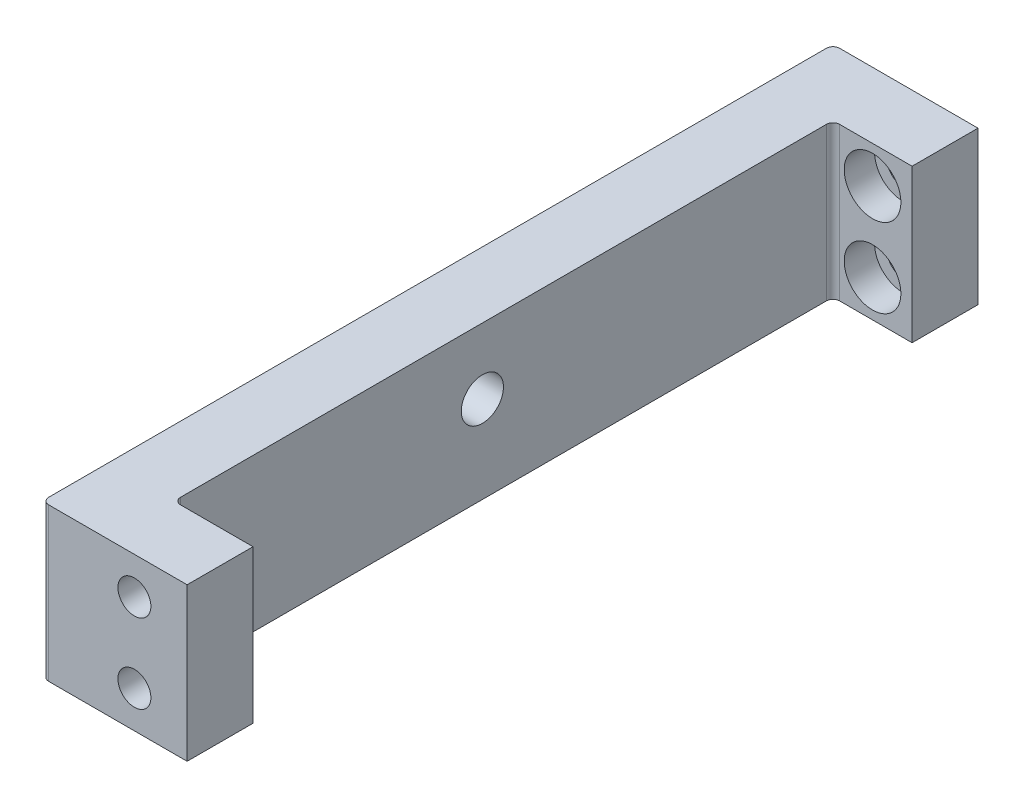
ISO-10303-21;
HEADER;
FILE_DESCRIPTION(('STEP AP214'),'2;1');
FILE_NAME('part.step','',(''),(''),'','','');
FILE_SCHEMA(('AUTOMOTIVE_DESIGN { 1 0 10303 214 1 1 1 1 }'));
ENDSEC;
DATA;
#1=APPLICATION_CONTEXT('core data for automotive mechanical design processes');
#2=APPLICATION_PROTOCOL_DEFINITION('international standard','automotive_design',2000,#1);
#3=PRODUCT_CONTEXT('',#1,'mechanical');
#4=PRODUCT('Part','Part','',(#3));
#5=PRODUCT_RELATED_PRODUCT_CATEGORY('part','',(#4));
#6=PRODUCT_DEFINITION_FORMATION('','',#4);
#7=PRODUCT_DEFINITION_CONTEXT('part definition',#1,'design');
#8=PRODUCT_DEFINITION('design','',#6,#7);
#9=PRODUCT_DEFINITION_SHAPE('','',#8);
#10=(LENGTH_UNIT() NAMED_UNIT(*) SI_UNIT(.MILLI.,.METRE.));
#11=(NAMED_UNIT(*) PLANE_ANGLE_UNIT() SI_UNIT($,.RADIAN.));
#12=(NAMED_UNIT(*) SI_UNIT($,.STERADIAN.) SOLID_ANGLE_UNIT());
#13=UNCERTAINTY_MEASURE_WITH_UNIT(LENGTH_MEASURE(1.E-05),#10,'distance_accuracy_value','');
#14=(GEOMETRIC_REPRESENTATION_CONTEXT(3) GLOBAL_UNCERTAINTY_ASSIGNED_CONTEXT((#13)) GLOBAL_UNIT_ASSIGNED_CONTEXT((#10,
#11,#12)) REPRESENTATION_CONTEXT('',''));
#15=CARTESIAN_POINT('',(0.,0.,0.));
#16=DIRECTION('',(0.,0.,1.));
#17=DIRECTION('',(1.,0.,0.));
#18=AXIS2_PLACEMENT_3D('',#15,#16,#17);
#19=CARTESIAN_POINT('',(2.5,-5.8,30.));
#20=DIRECTION('',(-1.,0.,0.));
#21=DIRECTION('',(0.,0.,1.));
#22=AXIS2_PLACEMENT_3D('',#19,#20,#21);
#23=PLANE('',#22);
#24=CARTESIAN_POINT('',(2.5,0.799999999999973,1.6));
#25=DIRECTION('',(-1.,0.,0.));
#26=DIRECTION('',(0.,0.,1.));
#27=AXIS2_PLACEMENT_3D('',#24,#25,#26);
#28=CIRCLE('',#27,1.59999999999999);
#29=CARTESIAN_POINT('',(2.5,0.799999999999973,3.19999999999999));
#30=VERTEX_POINT('',#29);
#31=EDGE_CURVE('E153',#30,#30,#28,.T.);
#32=ORIENTED_EDGE('',*,*,#31,.T.);
#33=EDGE_LOOP('',(#32));
#34=FACE_BOUND('',#33,.T.);
#35=DIRECTION('',(0.,0.,-1.));
#36=VECTOR('',#35,1.);
#37=CARTESIAN_POINT('',(2.5,-5.8,30.));
#38=LINE('',#37,#36);
#39=CARTESIAN_POINT('',(2.5,-5.8,24.5));
#40=VERTEX_POINT('',#39);
#41=CARTESIAN_POINT('',(2.5,-5.8,-24.5));
#42=VERTEX_POINT('',#41);
#43=EDGE_CURVE('E271',#40,#42,#38,.T.);
#44=ORIENTED_EDGE('',*,*,#43,.T.);
#45=DIRECTION('',(0.,1.,0.));
#46=VECTOR('',#45,1.);
#47=CARTESIAN_POINT('',(2.5,-5.80000000000002,-24.5));
#48=LINE('',#47,#46);
#49=CARTESIAN_POINT('',(2.5,5.8,-24.5));
#50=VERTEX_POINT('',#49);
#51=EDGE_CURVE('E309',#42,#50,#48,.T.);
#52=ORIENTED_EDGE('',*,*,#51,.T.);
#53=DIRECTION('',(0.,0.,-1.));
#54=VECTOR('',#53,1.);
#55=CARTESIAN_POINT('',(2.5,5.8,30.));
#56=LINE('',#55,#54);
#57=CARTESIAN_POINT('',(2.5,5.8,24.5));
#58=VERTEX_POINT('',#57);
#59=EDGE_CURVE('E268',#58,#50,#56,.T.);
#60=ORIENTED_EDGE('',*,*,#59,.F.);
#61=DIRECTION('',(0.,1.,0.));
#62=VECTOR('',#61,1.);
#63=CARTESIAN_POINT('',(2.5,-5.8,24.5));
#64=LINE('',#63,#62);
#65=EDGE_CURVE('E306',#58,#40,#64,.F.);
#66=ORIENTED_EDGE('',*,*,#65,.T.);
#67=EDGE_LOOP('',(#44,#52,#60,#66));
#68=FACE_BOUND('',#67,.T.);
#69=ADVANCED_FACE('F46',(#34,#68),#23,.F.);
#70=CARTESIAN_POINT('',(-2.5,-5.8,30.));
#71=DIRECTION('',(1.,0.,0.));
#72=DIRECTION('',(0.,0.,-1.));
#73=AXIS2_PLACEMENT_3D('',#70,#71,#72);
#74=PLANE('',#73);
#75=CARTESIAN_POINT('',(-2.5,0.799999999999973,1.6));
#76=DIRECTION('',(-1.,0.,0.));
#77=DIRECTION('',(0.,0.,1.));
#78=AXIS2_PLACEMENT_3D('',#75,#76,#77);
#79=CIRCLE('',#78,1.59999999999999);
#80=CARTESIAN_POINT('',(-2.5,0.799999999999973,3.19999999999999));
#81=VERTEX_POINT('',#80);
#82=EDGE_CURVE('E147',#81,#81,#79,.T.);
#83=ORIENTED_EDGE('',*,*,#82,.F.);
#84=EDGE_LOOP('',(#83));
#85=FACE_BOUND('',#84,.T.);
#86=DIRECTION('',(0.,0.,-1.));
#87=VECTOR('',#86,1.);
#88=CARTESIAN_POINT('',(-2.5,5.8,30.));
#89=LINE('',#88,#87);
#90=CARTESIAN_POINT('',(-2.5,5.8,29.5));
#91=VERTEX_POINT('',#90);
#92=CARTESIAN_POINT('',(-2.5,5.8,-29.5));
#93=VERTEX_POINT('',#92);
#94=EDGE_CURVE('E259',#91,#93,#89,.T.);
#95=ORIENTED_EDGE('',*,*,#94,.T.);
#96=DIRECTION('',(0.,-1.,0.));
#97=VECTOR('',#96,1.);
#98=CARTESIAN_POINT('',(-2.5,-5.8,-29.5));
#99=LINE('',#98,#97);
#100=CARTESIAN_POINT('',(-2.5,-5.8,-29.5));
#101=VERTEX_POINT('',#100);
#102=EDGE_CURVE('E288',#93,#101,#99,.T.);
#103=ORIENTED_EDGE('',*,*,#102,.T.);
#104=DIRECTION('',(0.,0.,-1.));
#105=VECTOR('',#104,1.);
#106=CARTESIAN_POINT('',(-2.5,-5.8,30.));
#107=LINE('',#106,#105);
#108=CARTESIAN_POINT('',(-2.5,-5.8,29.5));
#109=VERTEX_POINT('',#108);
#110=EDGE_CURVE('E275',#109,#101,#107,.T.);
#111=ORIENTED_EDGE('',*,*,#110,.F.);
#112=DIRECTION('',(0.,-1.,0.));
#113=VECTOR('',#112,1.);
#114=CARTESIAN_POINT('',(-2.5,5.8,29.5));
#115=LINE('',#114,#113);
#116=EDGE_CURVE('E279',#109,#91,#115,.F.);
#117=ORIENTED_EDGE('',*,*,#116,.T.);
#118=EDGE_LOOP('',(#95,#103,#111,#117));
#119=FACE_BOUND('',#118,.T.);
#120=ADVANCED_FACE('F358',(#85,#119),#74,.F.);
#121=CARTESIAN_POINT('',(2.5,-5.8,30.));
#122=DIRECTION('',(0.,1.,0.));
#123=DIRECTION('',(0.,0.,1.));
#124=AXIS2_PLACEMENT_3D('',#121,#122,#123);
#125=PLANE('',#124);
#126=CARTESIAN_POINT('',(0.325000000000023,-5.8,-8.99999999999999));
#127=DIRECTION('',(0.,-1.,0.));
#128=DIRECTION('',(0.,0.,-1.));
#129=AXIS2_PLACEMENT_3D('',#126,#127,#128);
#130=CIRCLE('',#129,0.79999999999999);
#131=CARTESIAN_POINT('',(0.325000000000023,-5.8,-9.79999999999998));
#132=VERTEX_POINT('',#131);
#133=EDGE_CURVE('E148',#132,#132,#130,.T.);
#134=ORIENTED_EDGE('',*,*,#133,.F.);
#135=EDGE_LOOP('',(#134));
#136=FACE_BOUND('',#135,.T.);
#137=ORIENTED_EDGE('',*,*,#110,.T.);
#138=CARTESIAN_POINT('',(-2.,-5.8,-29.5));
#139=DIRECTION('',(0.,1.,0.));
#140=DIRECTION('',(0.,0.,1.));
#141=AXIS2_PLACEMENT_3D('',#138,#139,#140);
#142=CIRCLE('',#141,0.5);
#143=CARTESIAN_POINT('',(-2.,-5.8,-30.));
#144=VERTEX_POINT('',#143);
#145=EDGE_CURVE('E295',#101,#144,#142,.F.);
#146=ORIENTED_EDGE('',*,*,#145,.T.);
#147=DIRECTION('',(1.,0.,0.));
#148=VECTOR('',#147,1.);
#149=CARTESIAN_POINT('',(2.5,-5.8,-30.));
#150=LINE('',#149,#148);
#151=CARTESIAN_POINT('',(8.5,-5.8,-30.));
#152=VERTEX_POINT('',#151);
#153=EDGE_CURVE('E250',#144,#152,#150,.T.);
#154=ORIENTED_EDGE('',*,*,#153,.T.);
#155=DIRECTION('',(0.,0.,1.));
#156=VECTOR('',#155,1.);
#157=CARTESIAN_POINT('',(8.5,-5.8,-25.));
#158=LINE('',#157,#156);
#159=CARTESIAN_POINT('',(8.5,-5.8,-25.));
#160=VERTEX_POINT('',#159);
#161=EDGE_CURVE('E204',#152,#160,#158,.T.);
#162=ORIENTED_EDGE('',*,*,#161,.T.);
#163=DIRECTION('',(-1.,0.,0.));
#164=VECTOR('',#163,1.);
#165=CARTESIAN_POINT('',(8.5,-5.8,-25.));
#166=LINE('',#165,#164);
#167=CARTESIAN_POINT('',(3.,-5.8,-25.));
#168=VERTEX_POINT('',#167);
#169=EDGE_CURVE('E220',#160,#168,#166,.T.);
#170=ORIENTED_EDGE('',*,*,#169,.T.);
#171=CARTESIAN_POINT('',(3.,-5.8,-24.5));
#172=DIRECTION('',(0.,1.,0.));
#173=DIRECTION('',(0.,0.,1.));
#174=AXIS2_PLACEMENT_3D('',#171,#172,#173);
#175=CIRCLE('',#174,0.5);
#176=EDGE_CURVE('E325',#168,#42,#175,.T.);
#177=ORIENTED_EDGE('',*,*,#176,.T.);
#178=ORIENTED_EDGE('',*,*,#43,.F.);
#179=CARTESIAN_POINT('',(3.,-5.8,24.5));
#180=DIRECTION('',(0.,1.,0.));
#181=DIRECTION('',(0.,0.,1.));
#182=AXIS2_PLACEMENT_3D('',#179,#180,#181);
#183=CIRCLE('',#182,0.5);
#184=CARTESIAN_POINT('',(3.,-5.8,25.));
#185=VERTEX_POINT('',#184);
#186=EDGE_CURVE('E11',#40,#185,#183,.T.);
#187=ORIENTED_EDGE('',*,*,#186,.T.);
#188=DIRECTION('',(-1.,0.,0.));
#189=VECTOR('',#188,1.);
#190=CARTESIAN_POINT('',(8.5,-5.8,25.));
#191=LINE('',#190,#189);
#192=CARTESIAN_POINT('',(8.5,-5.8,25.));
#193=VERTEX_POINT('',#192);
#194=EDGE_CURVE('E246',#193,#185,#191,.T.);
#195=ORIENTED_EDGE('',*,*,#194,.F.);
#196=DIRECTION('',(0.,0.,-1.));
#197=VECTOR('',#196,1.);
#198=CARTESIAN_POINT('',(8.5,-5.8,25.));
#199=LINE('',#198,#197);
#200=CARTESIAN_POINT('',(8.5,-5.8,30.));
#201=VERTEX_POINT('',#200);
#202=EDGE_CURVE('E227',#201,#193,#199,.T.);
#203=ORIENTED_EDGE('',*,*,#202,.F.);
#204=DIRECTION('',(1.,0.,0.));
#205=VECTOR('',#204,1.);
#206=CARTESIAN_POINT('',(2.5,-5.8,30.));
#207=LINE('',#206,#205);
#208=CARTESIAN_POINT('',(-2.,-5.8,30.));
#209=VERTEX_POINT('',#208);
#210=EDGE_CURVE('E251',#209,#201,#207,.T.);
#211=ORIENTED_EDGE('',*,*,#210,.F.);
#212=CARTESIAN_POINT('',(-2.,-5.8,29.5));
#213=DIRECTION('',(0.,1.,0.));
#214=DIRECTION('',(0.,0.,1.));
#215=AXIS2_PLACEMENT_3D('',#212,#213,#214);
#216=CIRCLE('',#215,0.5);
#217=EDGE_CURVE('E292',#209,#109,#216,.F.);
#218=ORIENTED_EDGE('',*,*,#217,.T.);
#219=EDGE_LOOP('',(#137,#146,#154,#162,#170,#177,#178,#187,#195,#203,#211,#218));
#220=FACE_BOUND('',#219,.T.);
#221=ADVANCED_FACE('F341',(#136,#220),#125,.F.);
#222=CARTESIAN_POINT('',(2.5,5.8,30.));
#223=DIRECTION('',(0.,-1.,0.));
#224=DIRECTION('',(0.,0.,-1.));
#225=AXIS2_PLACEMENT_3D('',#222,#223,#224);
#226=PLANE('',#225);
#227=DIRECTION('',(-1.,0.,0.));
#228=VECTOR('',#227,1.);
#229=CARTESIAN_POINT('',(2.5,5.8,-30.));
#230=LINE('',#229,#228);
#231=CARTESIAN_POINT('',(8.5,5.8,-30.));
#232=VERTEX_POINT('',#231);
#233=CARTESIAN_POINT('',(-2.,5.8,-30.));
#234=VERTEX_POINT('',#233);
#235=EDGE_CURVE('E255',#232,#234,#230,.T.);
#236=ORIENTED_EDGE('',*,*,#235,.T.);
#237=CARTESIAN_POINT('',(-2.,5.8,-29.5));
#238=DIRECTION('',(0.,-1.,0.));
#239=DIRECTION('',(0.,0.,-1.));
#240=AXIS2_PLACEMENT_3D('',#237,#238,#239);
#241=CIRCLE('',#240,0.5);
#242=EDGE_CURVE('E303',#234,#93,#241,.F.);
#243=ORIENTED_EDGE('',*,*,#242,.T.);
#244=ORIENTED_EDGE('',*,*,#94,.F.);
#245=CARTESIAN_POINT('',(-2.,5.8,29.5));
#246=DIRECTION('',(0.,-1.,0.));
#247=DIRECTION('',(0.,0.,-1.));
#248=AXIS2_PLACEMENT_3D('',#245,#246,#247);
#249=CIRCLE('',#248,0.5);
#250=CARTESIAN_POINT('',(-2.,5.8,30.));
#251=VERTEX_POINT('',#250);
#252=EDGE_CURVE('E300',#91,#251,#249,.F.);
#253=ORIENTED_EDGE('',*,*,#252,.T.);
#254=DIRECTION('',(-1.,0.,0.));
#255=VECTOR('',#254,1.);
#256=CARTESIAN_POINT('',(2.5,5.8,30.));
#257=LINE('',#256,#255);
#258=CARTESIAN_POINT('',(8.5,5.8,30.));
#259=VERTEX_POINT('',#258);
#260=EDGE_CURVE('E254',#259,#251,#257,.T.);
#261=ORIENTED_EDGE('',*,*,#260,.F.);
#262=DIRECTION('',(0.,0.,1.));
#263=VECTOR('',#262,1.);
#264=CARTESIAN_POINT('',(8.5,5.8,30.));
#265=LINE('',#264,#263);
#266=CARTESIAN_POINT('',(8.5,5.8,25.));
#267=VERTEX_POINT('',#266);
#268=EDGE_CURVE('E234',#267,#259,#265,.T.);
#269=ORIENTED_EDGE('',*,*,#268,.F.);
#270=DIRECTION('',(-1.,0.,0.));
#271=VECTOR('',#270,1.);
#272=CARTESIAN_POINT('',(8.5,5.8,25.));
#273=LINE('',#272,#271);
#274=CARTESIAN_POINT('',(3.,5.8,25.));
#275=VERTEX_POINT('',#274);
#276=EDGE_CURVE('E242',#267,#275,#273,.T.);
#277=ORIENTED_EDGE('',*,*,#276,.T.);
#278=CARTESIAN_POINT('',(3.,5.8,24.5));
#279=DIRECTION('',(0.,-1.,0.));
#280=DIRECTION('',(0.,0.,-1.));
#281=AXIS2_PLACEMENT_3D('',#278,#279,#280);
#282=CIRCLE('',#281,0.5);
#283=EDGE_CURVE('E55',#275,#58,#282,.T.);
#284=ORIENTED_EDGE('',*,*,#283,.T.);
#285=ORIENTED_EDGE('',*,*,#59,.T.);
#286=CARTESIAN_POINT('',(3.,5.8,-24.5));
#287=DIRECTION('',(0.,-1.,0.));
#288=DIRECTION('',(0.,0.,-1.));
#289=AXIS2_PLACEMENT_3D('',#286,#287,#288);
#290=CIRCLE('',#289,0.5);
#291=CARTESIAN_POINT('',(3.,5.8,-25.));
#292=VERTEX_POINT('',#291);
#293=EDGE_CURVE('E62',#50,#292,#290,.T.);
#294=ORIENTED_EDGE('',*,*,#293,.T.);
#295=DIRECTION('',(-1.,0.,0.));
#296=VECTOR('',#295,1.);
#297=CARTESIAN_POINT('',(8.5,5.8,-25.));
#298=LINE('',#297,#296);
#299=CARTESIAN_POINT('',(8.5,5.8,-25.));
#300=VERTEX_POINT('',#299);
#301=EDGE_CURVE('E224',#300,#292,#298,.T.);
#302=ORIENTED_EDGE('',*,*,#301,.F.);
#303=DIRECTION('',(0.,0.,-1.));
#304=VECTOR('',#303,1.);
#305=CARTESIAN_POINT('',(8.5,5.8,-30.));
#306=LINE('',#305,#304);
#307=EDGE_CURVE('E212',#300,#232,#306,.T.);
#308=ORIENTED_EDGE('',*,*,#307,.T.);
#309=EDGE_LOOP('',(#236,#243,#244,#253,#261,#269,#277,#284,#285,#294,#302,#308));
#310=FACE_BOUND('',#309,.T.);
#311=ADVANCED_FACE('F329',(#310),#226,.F.);
#312=CARTESIAN_POINT('',(0.,0.,30.));
#313=DIRECTION('',(0.,0.,1.));
#314=DIRECTION('',(1.,0.,0.));
#315=AXIS2_PLACEMENT_3D('',#312,#313,#314);
#316=PLANE('',#315);
#317=CARTESIAN_POINT('',(4.5,-3.,30.));
#318=DIRECTION('',(0.,0.,1.));
#319=DIRECTION('',(1.,0.,0.));
#320=AXIS2_PLACEMENT_3D('',#317,#318,#319);
#321=CIRCLE('',#320,1.24999999999999);
#322=CARTESIAN_POINT('',(5.74999999999999,-3.,30.));
#323=VERTEX_POINT('',#322);
#324=EDGE_CURVE('E188',#323,#323,#321,.T.);
#325=ORIENTED_EDGE('',*,*,#324,.F.);
#326=EDGE_LOOP('',(#325));
#327=FACE_BOUND('',#326,.T.);
#328=CARTESIAN_POINT('',(4.5,3.,30.));
#329=DIRECTION('',(0.,0.,1.));
#330=DIRECTION('',(1.,0.,0.));
#331=AXIS2_PLACEMENT_3D('',#328,#329,#330);
#332=CIRCLE('',#331,1.24999999999999);
#333=CARTESIAN_POINT('',(5.74999999999999,3.,30.));
#334=VERTEX_POINT('',#333);
#335=EDGE_CURVE('E196',#334,#334,#332,.T.);
#336=ORIENTED_EDGE('',*,*,#335,.F.);
#337=EDGE_LOOP('',(#336));
#338=FACE_BOUND('',#337,.T.);
#339=ORIENTED_EDGE('',*,*,#260,.T.);
#340=DIRECTION('',(0.,-1.,0.));
#341=VECTOR('',#340,1.);
#342=CARTESIAN_POINT('',(-2.,-5.8,30.));
#343=LINE('',#342,#341);
#344=EDGE_CURVE('E319',#251,#209,#343,.T.);
#345=ORIENTED_EDGE('',*,*,#344,.T.);
#346=ORIENTED_EDGE('',*,*,#210,.T.);
#347=DIRECTION('',(0.,-1.,0.));
#348=VECTOR('',#347,1.);
#349=CARTESIAN_POINT('',(8.5,-5.8,30.));
#350=LINE('',#349,#348);
#351=EDGE_CURVE('E238',#259,#201,#350,.T.);
#352=ORIENTED_EDGE('',*,*,#351,.F.);
#353=EDGE_LOOP('',(#339,#345,#346,#352));
#354=FACE_BOUND('',#353,.T.);
#355=ADVANCED_FACE('F351',(#327,#338,#354),#316,.T.);
#356=CARTESIAN_POINT('',(0.,0.,-30.));
#357=DIRECTION('',(0.,0.,1.));
#358=DIRECTION('',(1.,0.,0.));
#359=AXIS2_PLACEMENT_3D('',#356,#357,#358);
#360=PLANE('',#359);
#361=CARTESIAN_POINT('',(5.5,-3.00000000000001,-30.));
#362=DIRECTION('',(0.,0.,1.));
#363=DIRECTION('',(1.,0.,0.));
#364=AXIS2_PLACEMENT_3D('',#361,#362,#363);
#365=CIRCLE('',#364,1.2);
#366=CARTESIAN_POINT('',(6.7,-3.00000000000001,-30.));
#367=VERTEX_POINT('',#366);
#368=EDGE_CURVE('E174',#367,#367,#365,.T.);
#369=ORIENTED_EDGE('',*,*,#368,.T.);
#370=EDGE_LOOP('',(#369));
#371=FACE_BOUND('',#370,.T.);
#372=CARTESIAN_POINT('',(5.5,2.99999999999999,-30.));
#373=DIRECTION('',(0.,0.,1.));
#374=DIRECTION('',(1.,0.,0.));
#375=AXIS2_PLACEMENT_3D('',#372,#373,#374);
#376=CIRCLE('',#375,1.2);
#377=CARTESIAN_POINT('',(6.7,2.99999999999999,-30.));
#378=VERTEX_POINT('',#377);
#379=EDGE_CURVE('E187',#378,#378,#376,.T.);
#380=ORIENTED_EDGE('',*,*,#379,.T.);
#381=EDGE_LOOP('',(#380));
#382=FACE_BOUND('',#381,.T.);
#383=ORIENTED_EDGE('',*,*,#153,.F.);
#384=DIRECTION('',(0.,-1.,0.));
#385=VECTOR('',#384,1.);
#386=CARTESIAN_POINT('',(-2.,0.,-30.));
#387=LINE('',#386,#385);
#388=EDGE_CURVE('E297',#144,#234,#387,.F.);
#389=ORIENTED_EDGE('',*,*,#388,.T.);
#390=ORIENTED_EDGE('',*,*,#235,.F.);
#391=DIRECTION('',(0.,-1.,0.));
#392=VECTOR('',#391,1.);
#393=CARTESIAN_POINT('',(8.5,-5.8,-30.));
#394=LINE('',#393,#392);
#395=EDGE_CURVE('E208',#232,#152,#394,.T.);
#396=ORIENTED_EDGE('',*,*,#395,.T.);
#397=EDGE_LOOP('',(#383,#389,#390,#396));
#398=FACE_BOUND('',#397,.T.);
#399=ADVANCED_FACE('F367',(#371,#382,#398),#360,.F.);
#400=CARTESIAN_POINT('',(8.5,5.8,25.));
#401=DIRECTION('',(0.,0.,1.));
#402=DIRECTION('',(0.,-1.,0.));
#403=AXIS2_PLACEMENT_3D('',#400,#401,#402);
#404=PLANE('',#403);
#405=CARTESIAN_POINT('',(4.5,-3.,25.));
#406=DIRECTION('',(0.,0.,1.));
#407=DIRECTION('',(0.,-1.,0.));
#408=AXIS2_PLACEMENT_3D('',#405,#406,#407);
#409=CIRCLE('',#408,1.24999999999999);
#410=CARTESIAN_POINT('',(4.5,-4.24999999999999,25.));
#411=VERTEX_POINT('',#410);
#412=EDGE_CURVE('E192',#411,#411,#409,.T.);
#413=ORIENTED_EDGE('',*,*,#412,.T.);
#414=EDGE_LOOP('',(#413));
#415=FACE_BOUND('',#414,.T.);
#416=CARTESIAN_POINT('',(4.5,3.,25.));
#417=DIRECTION('',(0.,0.,1.));
#418=DIRECTION('',(0.,-1.,0.));
#419=AXIS2_PLACEMENT_3D('',#416,#417,#418);
#420=CIRCLE('',#419,1.24999999999999);
#421=CARTESIAN_POINT('',(4.5,1.75000000000001,25.));
#422=VERTEX_POINT('',#421);
#423=EDGE_CURVE('E200',#422,#422,#420,.T.);
#424=ORIENTED_EDGE('',*,*,#423,.T.);
#425=EDGE_LOOP('',(#424));
#426=FACE_BOUND('',#425,.T.);
#427=ORIENTED_EDGE('',*,*,#194,.T.);
#428=DIRECTION('',(0.,1.,0.));
#429=VECTOR('',#428,1.);
#430=CARTESIAN_POINT('',(3.,5.8,25.));
#431=LINE('',#430,#429);
#432=EDGE_CURVE('E315',#185,#275,#431,.T.);
#433=ORIENTED_EDGE('',*,*,#432,.T.);
#434=ORIENTED_EDGE('',*,*,#276,.F.);
#435=DIRECTION('',(0.,1.,0.));
#436=VECTOR('',#435,1.);
#437=CARTESIAN_POINT('',(8.5,5.8,25.));
#438=LINE('',#437,#436);
#439=EDGE_CURVE('E231',#193,#267,#438,.T.);
#440=ORIENTED_EDGE('',*,*,#439,.F.);
#441=EDGE_LOOP('',(#427,#433,#434,#440));
#442=FACE_BOUND('',#441,.T.);
#443=ADVANCED_FACE('F344',(#415,#426,#442),#404,.F.);
#444=CARTESIAN_POINT('',(8.5,0.,0.));
#445=DIRECTION('',(-1.,0.,0.));
#446=DIRECTION('',(0.,0.,1.));
#447=AXIS2_PLACEMENT_3D('',#444,#445,#446);
#448=PLANE('',#447);
#449=ORIENTED_EDGE('',*,*,#202,.T.);
#450=ORIENTED_EDGE('',*,*,#439,.T.);
#451=ORIENTED_EDGE('',*,*,#268,.T.);
#452=ORIENTED_EDGE('',*,*,#351,.T.);
#453=EDGE_LOOP('',(#449,#450,#451,#452));
#454=FACE_BOUND('',#453,.T.);
#455=ADVANCED_FACE('F346',(#454),#448,.F.);
#456=CARTESIAN_POINT('',(8.5,5.8,-25.));
#457=DIRECTION('',(0.,0.,1.));
#458=DIRECTION('',(0.,-1.,0.));
#459=AXIS2_PLACEMENT_3D('',#456,#457,#458);
#460=PLANE('',#459);
#461=CARTESIAN_POINT('',(5.5,-3.00000000000001,-25.));
#462=DIRECTION('',(0.,0.,1.));
#463=DIRECTION('',(1.,0.,0.));
#464=AXIS2_PLACEMENT_3D('',#461,#462,#463);
#465=CIRCLE('',#464,2.15);
#466=CARTESIAN_POINT('',(7.65,-3.00000000000001,-25.));
#467=VERTEX_POINT('',#466);
#468=EDGE_CURVE('E162',#467,#467,#465,.T.);
#469=ORIENTED_EDGE('',*,*,#468,.F.);
#470=EDGE_LOOP('',(#469));
#471=FACE_BOUND('',#470,.T.);
#472=CARTESIAN_POINT('',(5.5,2.99999999999999,-25.));
#473=DIRECTION('',(0.,0.,1.));
#474=DIRECTION('',(1.,0.,0.));
#475=AXIS2_PLACEMENT_3D('',#472,#473,#474);
#476=CIRCLE('',#475,2.15);
#477=CARTESIAN_POINT('',(7.65,2.99999999999999,-25.));
#478=VERTEX_POINT('',#477);
#479=EDGE_CURVE('E175',#478,#478,#476,.T.);
#480=ORIENTED_EDGE('',*,*,#479,.F.);
#481=EDGE_LOOP('',(#480));
#482=FACE_BOUND('',#481,.T.);
#483=ORIENTED_EDGE('',*,*,#301,.T.);
#484=DIRECTION('',(0.,1.,0.));
#485=VECTOR('',#484,1.);
#486=CARTESIAN_POINT('',(3.,5.8,-25.));
#487=LINE('',#486,#485);
#488=EDGE_CURVE('E312',#292,#168,#487,.F.);
#489=ORIENTED_EDGE('',*,*,#488,.T.);
#490=ORIENTED_EDGE('',*,*,#169,.F.);
#491=DIRECTION('',(0.,1.,0.));
#492=VECTOR('',#491,1.);
#493=CARTESIAN_POINT('',(8.5,5.8,-25.));
#494=LINE('',#493,#492);
#495=EDGE_CURVE('E216',#160,#300,#494,.T.);
#496=ORIENTED_EDGE('',*,*,#495,.T.);
#497=EDGE_LOOP('',(#483,#489,#490,#496));
#498=FACE_BOUND('',#497,.T.);
#499=ADVANCED_FACE('F374',(#471,#482,#498),#460,.T.);
#500=CARTESIAN_POINT('',(8.5,0.,0.));
#501=DIRECTION('',(-1.,0.,0.));
#502=DIRECTION('',(0.,0.,-1.));
#503=AXIS2_PLACEMENT_3D('',#500,#501,#502);
#504=PLANE('',#503);
#505=ORIENTED_EDGE('',*,*,#161,.F.);
#506=ORIENTED_EDGE('',*,*,#395,.F.);
#507=ORIENTED_EDGE('',*,*,#307,.F.);
#508=ORIENTED_EDGE('',*,*,#495,.F.);
#509=EDGE_LOOP('',(#505,#506,#507,#508));
#510=FACE_BOUND('',#509,.T.);
#511=ADVANCED_FACE('F371',(#510),#504,.F.);
#512=CARTESIAN_POINT('',(4.5,3.,30.));
#513=DIRECTION('',(0.,0.,1.));
#514=DIRECTION('',(1.,0.,0.));
#515=AXIS2_PLACEMENT_3D('',#512,#513,#514);
#516=CYLINDRICAL_SURFACE('',#515,1.24999999999999);
#517=ORIENTED_EDGE('',*,*,#335,.T.);
#518=EDGE_LOOP('',(#517));
#519=FACE_BOUND('',#518,.T.);
#520=ORIENTED_EDGE('',*,*,#423,.F.);
#521=EDGE_LOOP('',(#520));
#522=FACE_BOUND('',#521,.T.);
#523=ADVANCED_FACE('F437',(#519,#522),#516,.F.);
#524=CARTESIAN_POINT('',(4.5,-3.,30.));
#525=DIRECTION('',(0.,0.,1.));
#526=DIRECTION('',(1.,0.,0.));
#527=AXIS2_PLACEMENT_3D('',#524,#525,#526);
#528=CYLINDRICAL_SURFACE('',#527,1.24999999999999);
#529=ORIENTED_EDGE('',*,*,#324,.T.);
#530=EDGE_LOOP('',(#529));
#531=FACE_BOUND('',#530,.T.);
#532=ORIENTED_EDGE('',*,*,#412,.F.);
#533=EDGE_LOOP('',(#532));
#534=FACE_BOUND('',#533,.T.);
#535=ADVANCED_FACE('F433',(#531,#534),#528,.F.);
#536=CARTESIAN_POINT('',(5.5,2.99999999999999,-25.));
#537=DIRECTION('',(0.,0.,1.));
#538=DIRECTION('',(1.,0.,0.));
#539=AXIS2_PLACEMENT_3D('',#536,#537,#538);
#540=CYLINDRICAL_SURFACE('',#539,1.2);
#541=CARTESIAN_POINT('',(5.5,2.99999999999999,-27.3));
#542=DIRECTION('',(0.,0.,1.));
#543=DIRECTION('',(1.,0.,0.));
#544=AXIS2_PLACEMENT_3D('',#541,#542,#543);
#545=CIRCLE('',#544,1.2);
#546=CARTESIAN_POINT('',(6.7,2.99999999999999,-27.3));
#547=VERTEX_POINT('',#546);
#548=EDGE_CURVE('E183',#547,#547,#545,.T.);
#549=ORIENTED_EDGE('',*,*,#548,.T.);
#550=EDGE_LOOP('',(#549));
#551=FACE_BOUND('',#550,.T.);
#552=ORIENTED_EDGE('',*,*,#379,.F.);
#553=EDGE_LOOP('',(#552));
#554=FACE_BOUND('',#553,.T.);
#555=ADVANCED_FACE('F429',(#551,#554),#540,.F.);
#556=CARTESIAN_POINT('',(6.7,2.99999999999999,-27.3));
#557=DIRECTION('',(0.,0.,-1.));
#558=DIRECTION('',(-1.,0.,0.));
#559=AXIS2_PLACEMENT_3D('',#556,#557,#558);
#560=PLANE('',#559);
#561=ORIENTED_EDGE('',*,*,#548,.F.);
#562=EDGE_LOOP('',(#561));
#563=FACE_BOUND('',#562,.T.);
#564=CARTESIAN_POINT('',(5.5,2.99999999999999,-27.3));
#565=DIRECTION('',(0.,0.,1.));
#566=DIRECTION('',(1.,0.,0.));
#567=AXIS2_PLACEMENT_3D('',#564,#565,#566);
#568=CIRCLE('',#567,2.15);
#569=CARTESIAN_POINT('',(7.65,2.99999999999999,-27.3));
#570=VERTEX_POINT('',#569);
#571=EDGE_CURVE('E179',#570,#570,#568,.T.);
#572=ORIENTED_EDGE('',*,*,#571,.T.);
#573=EDGE_LOOP('',(#572));
#574=FACE_BOUND('',#573,.T.);
#575=ADVANCED_FACE('F425',(#563,#574),#560,.F.);
#576=CARTESIAN_POINT('',(5.5,2.99999999999999,-25.));
#577=DIRECTION('',(0.,0.,1.));
#578=DIRECTION('',(1.,0.,0.));
#579=AXIS2_PLACEMENT_3D('',#576,#577,#578);
#580=CYLINDRICAL_SURFACE('',#579,2.15);
#581=ORIENTED_EDGE('',*,*,#571,.F.);
#582=EDGE_LOOP('',(#581));
#583=FACE_BOUND('',#582,.T.);
#584=ORIENTED_EDGE('',*,*,#479,.T.);
#585=EDGE_LOOP('',(#584));
#586=FACE_BOUND('',#585,.T.);
#587=ADVANCED_FACE('F421',(#583,#586),#580,.F.);
#588=CARTESIAN_POINT('',(5.5,-3.00000000000001,-25.));
#589=DIRECTION('',(0.,0.,1.));
#590=DIRECTION('',(1.,0.,0.));
#591=AXIS2_PLACEMENT_3D('',#588,#589,#590);
#592=CYLINDRICAL_SURFACE('',#591,1.2);
#593=CARTESIAN_POINT('',(5.5,-3.00000000000001,-27.3));
#594=DIRECTION('',(0.,0.,1.));
#595=DIRECTION('',(1.,0.,0.));
#596=AXIS2_PLACEMENT_3D('',#593,#594,#595);
#597=CIRCLE('',#596,1.2);
#598=CARTESIAN_POINT('',(6.7,-3.00000000000001,-27.3));
#599=VERTEX_POINT('',#598);
#600=EDGE_CURVE('E170',#599,#599,#597,.T.);
#601=ORIENTED_EDGE('',*,*,#600,.T.);
#602=EDGE_LOOP('',(#601));
#603=FACE_BOUND('',#602,.T.);
#604=ORIENTED_EDGE('',*,*,#368,.F.);
#605=EDGE_LOOP('',(#604));
#606=FACE_BOUND('',#605,.T.);
#607=ADVANCED_FACE('F417',(#603,#606),#592,.F.);
#608=CARTESIAN_POINT('',(6.7,-3.00000000000001,-27.3));
#609=DIRECTION('',(0.,0.,-1.));
#610=DIRECTION('',(-1.,0.,0.));
#611=AXIS2_PLACEMENT_3D('',#608,#609,#610);
#612=PLANE('',#611);
#613=ORIENTED_EDGE('',*,*,#600,.F.);
#614=EDGE_LOOP('',(#613));
#615=FACE_BOUND('',#614,.T.);
#616=CARTESIAN_POINT('',(5.5,-3.00000000000001,-27.3));
#617=DIRECTION('',(0.,0.,1.));
#618=DIRECTION('',(1.,0.,0.));
#619=AXIS2_PLACEMENT_3D('',#616,#617,#618);
#620=CIRCLE('',#619,2.15);
#621=CARTESIAN_POINT('',(7.65,-3.00000000000001,-27.3));
#622=VERTEX_POINT('',#621);
#623=EDGE_CURVE('E166',#622,#622,#620,.T.);
#624=ORIENTED_EDGE('',*,*,#623,.T.);
#625=EDGE_LOOP('',(#624));
#626=FACE_BOUND('',#625,.T.);
#627=ADVANCED_FACE('F413',(#615,#626),#612,.F.);
#628=CARTESIAN_POINT('',(5.5,-3.00000000000001,-25.));
#629=DIRECTION('',(0.,0.,1.));
#630=DIRECTION('',(1.,0.,0.));
#631=AXIS2_PLACEMENT_3D('',#628,#629,#630);
#632=CYLINDRICAL_SURFACE('',#631,2.15);
#633=ORIENTED_EDGE('',*,*,#623,.F.);
#634=EDGE_LOOP('',(#633));
#635=FACE_BOUND('',#634,.T.);
#636=ORIENTED_EDGE('',*,*,#468,.T.);
#637=EDGE_LOOP('',(#636));
#638=FACE_BOUND('',#637,.T.);
#639=ADVANCED_FACE('F383',(#635,#638),#632,.F.);
#640=CARTESIAN_POINT('',(-2.,-5.8,-29.5));
#641=DIRECTION('',(0.,-1.,0.));
#642=DIRECTION('',(0.,0.,-1.));
#643=AXIS2_PLACEMENT_3D('',#640,#641,#642);
#644=CYLINDRICAL_SURFACE('',#643,0.5);
#645=ORIENTED_EDGE('',*,*,#242,.F.);
#646=ORIENTED_EDGE('',*,*,#388,.F.);
#647=ORIENTED_EDGE('',*,*,#145,.F.);
#648=ORIENTED_EDGE('',*,*,#102,.F.);
#649=EDGE_LOOP('',(#645,#646,#647,#648));
#650=FACE_BOUND('',#649,.T.);
#651=ADVANCED_FACE('F363',(#650),#644,.T.);
#652=CARTESIAN_POINT('',(3.,-5.80000000000002,-24.5));
#653=DIRECTION('',(0.,1.,0.));
#654=DIRECTION('',(0.,0.,1.));
#655=AXIS2_PLACEMENT_3D('',#652,#653,#654);
#656=CYLINDRICAL_SURFACE('',#655,0.5);
#657=ORIENTED_EDGE('',*,*,#176,.F.);
#658=ORIENTED_EDGE('',*,*,#488,.F.);
#659=ORIENTED_EDGE('',*,*,#293,.F.);
#660=ORIENTED_EDGE('',*,*,#51,.F.);
#661=EDGE_LOOP('',(#657,#658,#659,#660));
#662=FACE_BOUND('',#661,.T.);
#663=ADVANCED_FACE('F376',(#662),#656,.F.);
#664=CARTESIAN_POINT('',(3.,5.8,24.5));
#665=DIRECTION('',(0.,-1.,0.));
#666=DIRECTION('',(0.,0.,-1.));
#667=AXIS2_PLACEMENT_3D('',#664,#665,#666);
#668=CYLINDRICAL_SURFACE('',#667,0.5);
#669=ORIENTED_EDGE('',*,*,#186,.F.);
#670=ORIENTED_EDGE('',*,*,#65,.F.);
#671=ORIENTED_EDGE('',*,*,#283,.F.);
#672=ORIENTED_EDGE('',*,*,#432,.F.);
#673=EDGE_LOOP('',(#669,#670,#671,#672));
#674=FACE_BOUND('',#673,.T.);
#675=ADVANCED_FACE('F338',(#674),#668,.F.);
#676=CARTESIAN_POINT('',(-2.,0.,29.5));
#677=DIRECTION('',(0.,1.,0.));
#678=DIRECTION('',(0.,0.,1.));
#679=AXIS2_PLACEMENT_3D('',#676,#677,#678);
#680=CYLINDRICAL_SURFACE('',#679,0.5);
#681=ORIENTED_EDGE('',*,*,#252,.F.);
#682=ORIENTED_EDGE('',*,*,#116,.F.);
#683=ORIENTED_EDGE('',*,*,#217,.F.);
#684=ORIENTED_EDGE('',*,*,#344,.F.);
#685=EDGE_LOOP('',(#681,#682,#683,#684));
#686=FACE_BOUND('',#685,.T.);
#687=ADVANCED_FACE('F48',(#686),#680,.T.);
#688=CARTESIAN_POINT('',(-2.5,0.799999999999973,1.6));
#689=DIRECTION('',(-1.,0.,0.));
#690=DIRECTION('',(0.,0.,1.));
#691=AXIS2_PLACEMENT_3D('',#688,#689,#690);
#692=CYLINDRICAL_SURFACE('',#691,1.59999999999999);
#693=ORIENTED_EDGE('',*,*,#82,.T.);
#694=EDGE_LOOP('',(#693));
#695=FACE_BOUND('',#694,.T.);
#696=ORIENTED_EDGE('',*,*,#31,.F.);
#697=EDGE_LOOP('',(#696));
#698=FACE_BOUND('',#697,.T.);
#699=ADVANCED_FACE('F140',(#695,#698),#692,.F.);
#700=CARTESIAN_POINT('',(0.325000000000023,-0.600000000000003,-8.99999999999999));
#701=DIRECTION('',(0.,-1.,0.));
#702=DIRECTION('',(0.,0.,-1.));
#703=AXIS2_PLACEMENT_3D('',#700,#701,#702);
#704=CONICAL_SURFACE('',#703,0.799999999999988,1.02974425867664);
#705=CARTESIAN_POINT('',(0.325000000000022,-0.11931150477795,-8.99999999999999));
#706=VERTEX_POINT('',#705);
#707=VERTEX_LOOP('',#706);
#708=FACE_BOUND('',#707,.T.);
#709=CARTESIAN_POINT('',(0.325000000000023,-0.600000000000003,-8.99999999999999));
#710=DIRECTION('',(0.,-1.,0.));
#711=DIRECTION('',(0.,0.,-1.));
#712=AXIS2_PLACEMENT_3D('',#709,#710,#711);
#713=CIRCLE('',#712,0.799999999999988);
#714=CARTESIAN_POINT('',(0.325000000000023,-0.600000000000003,-9.79999999999998));
#715=VERTEX_POINT('',#714);
#716=EDGE_CURVE('E144',#715,#715,#713,.T.);
#717=ORIENTED_EDGE('',*,*,#716,.T.);
#718=EDGE_LOOP('',(#717));
#719=FACE_BOUND('',#718,.T.);
#720=ADVANCED_FACE('F136',(#708,#719),#704,.F.);
#721=CARTESIAN_POINT('',(0.325000000000023,-5.8,-8.99999999999999));
#722=DIRECTION('',(0.,-1.,0.));
#723=DIRECTION('',(0.,0.,-1.));
#724=AXIS2_PLACEMENT_3D('',#721,#722,#723);
#725=CYLINDRICAL_SURFACE('',#724,0.799999999999989);
#726=ORIENTED_EDGE('',*,*,#716,.F.);
#727=EDGE_LOOP('',(#726));
#728=FACE_BOUND('',#727,.T.);
#729=ORIENTED_EDGE('',*,*,#133,.T.);
#730=EDGE_LOOP('',(#729));
#731=FACE_BOUND('',#730,.T.);
#732=ADVANCED_FACE('F139',(#728,#731),#725,.F.);
#733=CLOSED_SHELL('',(#69,#120,#221,#311,#355,#399,#443,#455,#499,#511,#523,#535,#555,#575,#587,
#607,#627,#639,#651,#663,#675,#687,#699,#720,#732));
#734=MANIFOLD_SOLID_BREP('B2',#733);
#735=ADVANCED_BREP_SHAPE_REPRESENTATION('',(#18,#734),#14);
#736=SHAPE_DEFINITION_REPRESENTATION(#9,#735);
ENDSEC;
END-ISO-10303-21;
